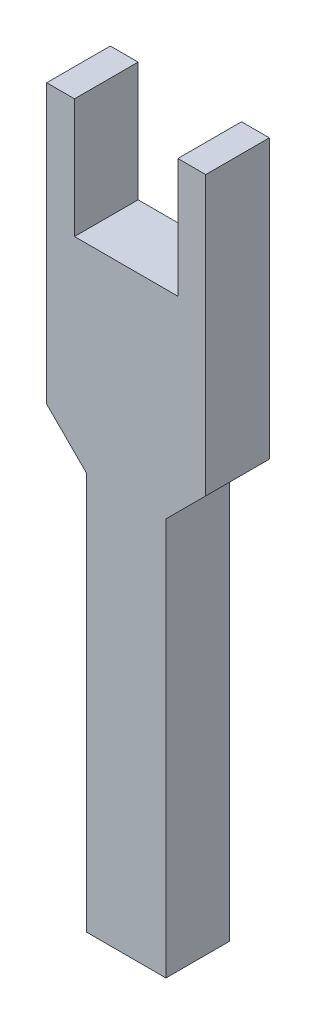
ISO-10303-21;
HEADER;
FILE_DESCRIPTION(('STEP AP214'),'2;1');
FILE_NAME('part.step','',(''),(''),'','','');
FILE_SCHEMA(('AUTOMOTIVE_DESIGN { 1 0 10303 214 1 1 1 1 }'));
ENDSEC;
DATA;
#1=APPLICATION_CONTEXT('core data for automotive mechanical design processes');
#2=APPLICATION_PROTOCOL_DEFINITION('international standard','automotive_design',2000,#1);
#3=PRODUCT_CONTEXT('',#1,'mechanical');
#4=PRODUCT('Part','Part','',(#3));
#5=PRODUCT_RELATED_PRODUCT_CATEGORY('part','',(#4));
#6=PRODUCT_DEFINITION_FORMATION('','',#4);
#7=PRODUCT_DEFINITION_CONTEXT('part definition',#1,'design');
#8=PRODUCT_DEFINITION('design','',#6,#7);
#9=PRODUCT_DEFINITION_SHAPE('','',#8);
#10=(LENGTH_UNIT() NAMED_UNIT(*) SI_UNIT(.MILLI.,.METRE.));
#11=(NAMED_UNIT(*) PLANE_ANGLE_UNIT() SI_UNIT($,.RADIAN.));
#12=(NAMED_UNIT(*) SI_UNIT($,.STERADIAN.) SOLID_ANGLE_UNIT());
#13=UNCERTAINTY_MEASURE_WITH_UNIT(LENGTH_MEASURE(1.E-05),#10,'distance_accuracy_value','');
#14=(GEOMETRIC_REPRESENTATION_CONTEXT(3) GLOBAL_UNCERTAINTY_ASSIGNED_CONTEXT((#13)) GLOBAL_UNIT_ASSIGNED_CONTEXT((#10,
#11,#12)) REPRESENTATION_CONTEXT('',''));
#15=CARTESIAN_POINT('',(0.,0.,0.));
#16=DIRECTION('',(0.,0.,1.));
#17=DIRECTION('',(1.,0.,0.));
#18=AXIS2_PLACEMENT_3D('',#15,#16,#17);
#19=CARTESIAN_POINT('',(-10.,20.,8.));
#20=DIRECTION('',(0.,-1.,0.));
#21=DIRECTION('',(0.,0.,-1.));
#22=AXIS2_PLACEMENT_3D('',#19,#20,#21);
#23=PLANE('',#22);
#24=DIRECTION('',(-1.,0.,0.));
#25=VECTOR('',#24,1.);
#26=CARTESIAN_POINT('',(-10.,20.,8.));
#27=LINE('',#26,#25);
#28=CARTESIAN_POINT('',(-6.5,20.,8.));
#29=VERTEX_POINT('',#28);
#30=CARTESIAN_POINT('',(-10.,20.,8.));
#31=VERTEX_POINT('',#30);
#32=EDGE_CURVE('E175',#29,#31,#27,.T.);
#33=ORIENTED_EDGE('',*,*,#32,.F.);
#34=DIRECTION('',(0.,0.,-1.));
#35=VECTOR('',#34,1.);
#36=CARTESIAN_POINT('',(-6.5,20.,8.));
#37=LINE('',#36,#35);
#38=CARTESIAN_POINT('',(-6.5,20.,0.));
#39=VERTEX_POINT('',#38);
#40=EDGE_CURVE('E158',#29,#39,#37,.T.);
#41=ORIENTED_EDGE('',*,*,#40,.T.);
#42=DIRECTION('',(-1.,0.,0.));
#43=VECTOR('',#42,1.);
#44=CARTESIAN_POINT('',(-10.,20.,0.));
#45=LINE('',#44,#43);
#46=CARTESIAN_POINT('',(-10.,20.,0.));
#47=VERTEX_POINT('',#46);
#48=EDGE_CURVE('E185',#39,#47,#45,.T.);
#49=ORIENTED_EDGE('',*,*,#48,.T.);
#50=DIRECTION('',(0.,0.,-1.));
#51=VECTOR('',#50,1.);
#52=CARTESIAN_POINT('',(-10.,20.,8.));
#53=LINE('',#52,#51);
#54=EDGE_CURVE('E183',#31,#47,#53,.T.);
#55=ORIENTED_EDGE('',*,*,#54,.F.);
#56=EDGE_LOOP('',(#33,#41,#49,#55));
#57=FACE_BOUND('',#56,.T.);
#58=ADVANCED_FACE('F33',(#57),#23,.F.);
#59=CARTESIAN_POINT('',(10.,20.,8.));
#60=DIRECTION('',(-1.,0.,0.));
#61=DIRECTION('',(0.,-1.,0.));
#62=AXIS2_PLACEMENT_3D('',#59,#60,#61);
#63=PLANE('',#62);
#64=DIRECTION('',(0.,1.,0.));
#65=VECTOR('',#64,1.);
#66=CARTESIAN_POINT('',(10.,20.,8.));
#67=LINE('',#66,#65);
#68=CARTESIAN_POINT('',(10.,-15.,8.));
#69=VERTEX_POINT('',#68);
#70=CARTESIAN_POINT('',(10.,20.,8.));
#71=VERTEX_POINT('',#70);
#72=EDGE_CURVE('E173',#69,#71,#67,.T.);
#73=ORIENTED_EDGE('',*,*,#72,.F.);
#74=DIRECTION('',(0.,0.,-1.));
#75=VECTOR('',#74,1.);
#76=CARTESIAN_POINT('',(10.,-15.,8.));
#77=LINE('',#76,#75);
#78=CARTESIAN_POINT('',(10.,-15.,0.));
#79=VERTEX_POINT('',#78);
#80=EDGE_CURVE('E205',#69,#79,#77,.T.);
#81=ORIENTED_EDGE('',*,*,#80,.T.);
#82=DIRECTION('',(0.,1.,0.));
#83=VECTOR('',#82,1.);
#84=CARTESIAN_POINT('',(10.,20.,0.));
#85=LINE('',#84,#83);
#86=CARTESIAN_POINT('',(10.,20.,0.));
#87=VERTEX_POINT('',#86);
#88=EDGE_CURVE('E166',#79,#87,#85,.T.);
#89=ORIENTED_EDGE('',*,*,#88,.T.);
#90=DIRECTION('',(0.,0.,-1.));
#91=VECTOR('',#90,1.);
#92=CARTESIAN_POINT('',(10.,20.,8.));
#93=LINE('',#92,#91);
#94=EDGE_CURVE('E193',#71,#87,#93,.T.);
#95=ORIENTED_EDGE('',*,*,#94,.F.);
#96=EDGE_LOOP('',(#73,#81,#89,#95));
#97=FACE_BOUND('',#96,.T.);
#98=ADVANCED_FACE('F210',(#97),#63,.F.);
#99=CARTESIAN_POINT('',(6.5,20.,0.));
#100=VERTEX_POINT('',#99);
#101=EDGE_CURVE('E186',#87,#100,#45,.T.);
#102=ORIENTED_EDGE('',*,*,#101,.T.);
#103=DIRECTION('',(0.,0.,-1.));
#104=VECTOR('',#103,1.);
#105=CARTESIAN_POINT('',(6.5,20.,8.));
#106=LINE('',#105,#104);
#107=CARTESIAN_POINT('',(6.5,20.,8.));
#108=VERTEX_POINT('',#107);
#109=EDGE_CURVE('E169',#108,#100,#106,.T.);
#110=ORIENTED_EDGE('',*,*,#109,.F.);
#111=EDGE_CURVE('E177',#71,#108,#27,.T.);
#112=ORIENTED_EDGE('',*,*,#111,.F.);
#113=ORIENTED_EDGE('',*,*,#94,.T.);
#114=EDGE_LOOP('',(#102,#110,#112,#113));
#115=FACE_BOUND('',#114,.T.);
#116=ADVANCED_FACE('F219',(#115),#23,.F.);
#117=CARTESIAN_POINT('',(-10.,20.,8.));
#118=DIRECTION('',(1.,0.,0.));
#119=DIRECTION('',(0.,1.,0.));
#120=AXIS2_PLACEMENT_3D('',#117,#118,#119);
#121=PLANE('',#120);
#122=DIRECTION('',(0.,-1.,0.));
#123=VECTOR('',#122,1.);
#124=CARTESIAN_POINT('',(-10.,20.,0.));
#125=LINE('',#124,#123);
#126=CARTESIAN_POINT('',(-10.,-15.,0.));
#127=VERTEX_POINT('',#126);
#128=EDGE_CURVE('E176',#47,#127,#125,.T.);
#129=ORIENTED_EDGE('',*,*,#128,.T.);
#130=DIRECTION('',(0.,0.,1.));
#131=VECTOR('',#130,1.);
#132=CARTESIAN_POINT('',(-10.,-15.,8.));
#133=LINE('',#132,#131);
#134=CARTESIAN_POINT('',(-10.,-15.,8.));
#135=VERTEX_POINT('',#134);
#136=EDGE_CURVE('E201',#127,#135,#133,.T.);
#137=ORIENTED_EDGE('',*,*,#136,.T.);
#138=DIRECTION('',(0.,-1.,0.));
#139=VECTOR('',#138,1.);
#140=CARTESIAN_POINT('',(-10.,20.,8.));
#141=LINE('',#140,#139);
#142=EDGE_CURVE('E180',#31,#135,#141,.T.);
#143=ORIENTED_EDGE('',*,*,#142,.F.);
#144=ORIENTED_EDGE('',*,*,#54,.T.);
#145=EDGE_LOOP('',(#129,#137,#143,#144));
#146=FACE_BOUND('',#145,.T.);
#147=ADVANCED_FACE('F236',(#146),#121,.F.);
#148=CARTESIAN_POINT('',(0.,0.,8.));
#149=DIRECTION('',(0.,0.,1.));
#150=DIRECTION('',(1.,0.,0.));
#151=AXIS2_PLACEMENT_3D('',#148,#149,#150);
#152=PLANE('',#151);
#153=DIRECTION('',(-0.707106781186546,0.707106781186549,0.));
#154=VECTOR('',#153,1.);
#155=CARTESIAN_POINT('',(-12.5,-12.5,8.));
#156=LINE('',#155,#154);
#157=CARTESIAN_POINT('',(-5.00000000000001,-20.,8.));
#158=VERTEX_POINT('',#157);
#159=EDGE_CURVE('E203',#135,#158,#156,.F.);
#160=ORIENTED_EDGE('',*,*,#159,.T.);
#161=DIRECTION('',(0.,1.,0.));
#162=VECTOR('',#161,1.);
#163=CARTESIAN_POINT('',(-5.00000000000001,-70.,8.));
#164=LINE('',#163,#162);
#165=CARTESIAN_POINT('',(-5.00000000000001,-70.,8.));
#166=VERTEX_POINT('',#165);
#167=EDGE_CURVE('E127',#166,#158,#164,.T.);
#168=ORIENTED_EDGE('',*,*,#167,.F.);
#169=DIRECTION('',(-1.,0.,0.));
#170=VECTOR('',#169,1.);
#171=CARTESIAN_POINT('',(4.99999999999998,-70.,8.));
#172=LINE('',#171,#170);
#173=CARTESIAN_POINT('',(4.99999999999998,-70.,8.));
#174=VERTEX_POINT('',#173);
#175=EDGE_CURVE('E120',#174,#166,#172,.T.);
#176=ORIENTED_EDGE('',*,*,#175,.F.);
#177=DIRECTION('',(0.,1.,0.));
#178=VECTOR('',#177,1.);
#179=CARTESIAN_POINT('',(4.99999999999998,-70.,8.));
#180=LINE('',#179,#178);
#181=CARTESIAN_POINT('',(4.99999999999998,-20.,8.));
#182=VERTEX_POINT('',#181);
#183=EDGE_CURVE('E124',#174,#182,#180,.T.);
#184=ORIENTED_EDGE('',*,*,#183,.T.);
#185=DIRECTION('',(-0.707106781186549,-0.707106781186546,0.));
#186=VECTOR('',#185,1.);
#187=CARTESIAN_POINT('',(12.5,-12.5,8.));
#188=LINE('',#187,#186);
#189=EDGE_CURVE('E11',#182,#69,#188,.F.);
#190=ORIENTED_EDGE('',*,*,#189,.T.);
#191=ORIENTED_EDGE('',*,*,#72,.T.);
#192=ORIENTED_EDGE('',*,*,#111,.T.);
#193=DIRECTION('',(0.,-1.,0.));
#194=VECTOR('',#193,1.);
#195=CARTESIAN_POINT('',(6.5,20.,8.));
#196=LINE('',#195,#194);
#197=CARTESIAN_POINT('',(6.5,5.,8.));
#198=VERTEX_POINT('',#197);
#199=EDGE_CURVE('E152',#108,#198,#196,.T.);
#200=ORIENTED_EDGE('',*,*,#199,.T.);
#201=DIRECTION('',(-1.,0.,0.));
#202=VECTOR('',#201,1.);
#203=CARTESIAN_POINT('',(6.5,5.,8.));
#204=LINE('',#203,#202);
#205=CARTESIAN_POINT('',(-6.5,5.,8.));
#206=VERTEX_POINT('',#205);
#207=EDGE_CURVE('E156',#198,#206,#204,.T.);
#208=ORIENTED_EDGE('',*,*,#207,.T.);
#209=DIRECTION('',(0.,1.,0.));
#210=VECTOR('',#209,1.);
#211=CARTESIAN_POINT('',(-6.5,20.,8.));
#212=LINE('',#211,#210);
#213=EDGE_CURVE('E149',#206,#29,#212,.T.);
#214=ORIENTED_EDGE('',*,*,#213,.T.);
#215=ORIENTED_EDGE('',*,*,#32,.T.);
#216=ORIENTED_EDGE('',*,*,#142,.T.);
#217=EDGE_LOOP('',(#160,#168,#176,#184,#190,#191,#192,#200,#208,#214,#215,#216));
#218=FACE_BOUND('',#217,.T.);
#219=ADVANCED_FACE('F122',(#218),#152,.T.);
#220=CARTESIAN_POINT('',(0.,0.,0.));
#221=DIRECTION('',(0.,0.,1.));
#222=DIRECTION('',(1.,0.,0.));
#223=AXIS2_PLACEMENT_3D('',#220,#221,#222);
#224=PLANE('',#223);
#225=ORIENTED_EDGE('',*,*,#88,.F.);
#226=DIRECTION('',(0.707106781186549,0.707106781186546,0.));
#227=VECTOR('',#226,1.);
#228=CARTESIAN_POINT('',(10.,-15.,0.));
#229=LINE('',#228,#227);
#230=CARTESIAN_POINT('',(4.99999999999998,-20.,0.));
#231=VERTEX_POINT('',#230);
#232=EDGE_CURVE('E54',#79,#231,#229,.F.);
#233=ORIENTED_EDGE('',*,*,#232,.T.);
#234=DIRECTION('',(0.,1.,0.));
#235=VECTOR('',#234,1.);
#236=CARTESIAN_POINT('',(4.99999999999998,-70.,0.));
#237=LINE('',#236,#235);
#238=CARTESIAN_POINT('',(4.99999999999998,-70.,0.));
#239=VERTEX_POINT('',#238);
#240=EDGE_CURVE('E247',#239,#231,#237,.T.);
#241=ORIENTED_EDGE('',*,*,#240,.F.);
#242=DIRECTION('',(1.,0.,0.));
#243=VECTOR('',#242,1.);
#244=CARTESIAN_POINT('',(4.99999999999998,-70.,0.));
#245=LINE('',#244,#243);
#246=CARTESIAN_POINT('',(-5.00000000000001,-70.,0.));
#247=VERTEX_POINT('',#246);
#248=EDGE_CURVE('E136',#247,#239,#245,.T.);
#249=ORIENTED_EDGE('',*,*,#248,.F.);
#250=DIRECTION('',(0.,1.,0.));
#251=VECTOR('',#250,1.);
#252=CARTESIAN_POINT('',(-5.00000000000001,-70.,0.));
#253=LINE('',#252,#251);
#254=CARTESIAN_POINT('',(-5.00000000000001,-20.,0.));
#255=VERTEX_POINT('',#254);
#256=EDGE_CURVE('E145',#247,#255,#253,.T.);
#257=ORIENTED_EDGE('',*,*,#256,.T.);
#258=DIRECTION('',(0.707106781186546,-0.707106781186549,0.));
#259=VECTOR('',#258,1.);
#260=CARTESIAN_POINT('',(-5.00000000000001,-20.,0.));
#261=LINE('',#260,#259);
#262=EDGE_CURVE('E199',#255,#127,#261,.F.);
#263=ORIENTED_EDGE('',*,*,#262,.T.);
#264=ORIENTED_EDGE('',*,*,#128,.F.);
#265=ORIENTED_EDGE('',*,*,#48,.F.);
#266=DIRECTION('',(0.,1.,0.));
#267=VECTOR('',#266,1.);
#268=CARTESIAN_POINT('',(-6.5,20.,0.));
#269=LINE('',#268,#267);
#270=CARTESIAN_POINT('',(-6.5,5.,0.));
#271=VERTEX_POINT('',#270);
#272=EDGE_CURVE('E141',#271,#39,#269,.T.);
#273=ORIENTED_EDGE('',*,*,#272,.F.);
#274=DIRECTION('',(-1.,0.,0.));
#275=VECTOR('',#274,1.);
#276=CARTESIAN_POINT('',(6.5,5.,0.));
#277=LINE('',#276,#275);
#278=CARTESIAN_POINT('',(6.5,5.,0.));
#279=VERTEX_POINT('',#278);
#280=EDGE_CURVE('E153',#279,#271,#277,.T.);
#281=ORIENTED_EDGE('',*,*,#280,.F.);
#282=DIRECTION('',(0.,-1.,0.));
#283=VECTOR('',#282,1.);
#284=CARTESIAN_POINT('',(6.5,20.,0.));
#285=LINE('',#284,#283);
#286=EDGE_CURVE('E143',#100,#279,#285,.T.);
#287=ORIENTED_EDGE('',*,*,#286,.F.);
#288=ORIENTED_EDGE('',*,*,#101,.F.);
#289=EDGE_LOOP('',(#225,#233,#241,#249,#257,#263,#264,#265,#273,#281,#287,#288));
#290=FACE_BOUND('',#289,.T.);
#291=ADVANCED_FACE('F213',(#290),#224,.F.);
#292=CARTESIAN_POINT('',(-6.5,20.,8.));
#293=DIRECTION('',(-1.,0.,0.));
#294=DIRECTION('',(0.,-1.,0.));
#295=AXIS2_PLACEMENT_3D('',#292,#293,#294);
#296=PLANE('',#295);
#297=ORIENTED_EDGE('',*,*,#272,.T.);
#298=ORIENTED_EDGE('',*,*,#40,.F.);
#299=ORIENTED_EDGE('',*,*,#213,.F.);
#300=DIRECTION('',(0.,0.,-1.));
#301=VECTOR('',#300,1.);
#302=CARTESIAN_POINT('',(-6.5,5.,8.));
#303=LINE('',#302,#301);
#304=EDGE_CURVE('E164',#206,#271,#303,.T.);
#305=ORIENTED_EDGE('',*,*,#304,.T.);
#306=EDGE_LOOP('',(#297,#298,#299,#305));
#307=FACE_BOUND('',#306,.T.);
#308=ADVANCED_FACE('F228',(#307),#296,.F.);
#309=CARTESIAN_POINT('',(6.5,5.,8.));
#310=DIRECTION('',(0.,-1.,0.));
#311=DIRECTION('',(0.,0.,-1.));
#312=AXIS2_PLACEMENT_3D('',#309,#310,#311);
#313=PLANE('',#312);
#314=ORIENTED_EDGE('',*,*,#280,.T.);
#315=ORIENTED_EDGE('',*,*,#304,.F.);
#316=ORIENTED_EDGE('',*,*,#207,.F.);
#317=DIRECTION('',(0.,0.,-1.));
#318=VECTOR('',#317,1.);
#319=CARTESIAN_POINT('',(6.5,5.,8.));
#320=LINE('',#319,#318);
#321=EDGE_CURVE('E167',#198,#279,#320,.T.);
#322=ORIENTED_EDGE('',*,*,#321,.T.);
#323=EDGE_LOOP('',(#314,#315,#316,#322));
#324=FACE_BOUND('',#323,.T.);
#325=ADVANCED_FACE('F224',(#324),#313,.F.);
#326=CARTESIAN_POINT('',(6.5,20.,8.));
#327=DIRECTION('',(1.,0.,0.));
#328=DIRECTION('',(0.,1.,0.));
#329=AXIS2_PLACEMENT_3D('',#326,#327,#328);
#330=PLANE('',#329);
#331=ORIENTED_EDGE('',*,*,#286,.T.);
#332=ORIENTED_EDGE('',*,*,#321,.F.);
#333=ORIENTED_EDGE('',*,*,#199,.F.);
#334=ORIENTED_EDGE('',*,*,#109,.T.);
#335=EDGE_LOOP('',(#331,#332,#333,#334));
#336=FACE_BOUND('',#335,.T.);
#337=ADVANCED_FACE('F222',(#336),#330,.F.);
#338=CARTESIAN_POINT('',(-5.00000000000001,-20.,8.));
#339=DIRECTION('',(0.707106781186549,0.707106781186546,0.));
#340=DIRECTION('',(0.,0.,-1.));
#341=AXIS2_PLACEMENT_3D('',#338,#339,#340);
#342=PLANE('',#341);
#343=ORIENTED_EDGE('',*,*,#159,.F.);
#344=ORIENTED_EDGE('',*,*,#136,.F.);
#345=ORIENTED_EDGE('',*,*,#262,.F.);
#346=DIRECTION('',(0.,0.,-1.));
#347=VECTOR('',#346,1.);
#348=CARTESIAN_POINT('',(-5.00000000000001,-20.,8.));
#349=LINE('',#348,#347);
#350=EDGE_CURVE('E196',#158,#255,#349,.T.);
#351=ORIENTED_EDGE('',*,*,#350,.F.);
#352=EDGE_LOOP('',(#343,#344,#345,#351));
#353=FACE_BOUND('',#352,.T.);
#354=ADVANCED_FACE('F241',(#353),#342,.F.);
#355=CARTESIAN_POINT('',(10.,-15.,8.));
#356=DIRECTION('',(-0.707106781186546,0.707106781186549,0.));
#357=DIRECTION('',(0.,0.,-1.));
#358=AXIS2_PLACEMENT_3D('',#355,#356,#357);
#359=PLANE('',#358);
#360=ORIENTED_EDGE('',*,*,#189,.F.);
#361=DIRECTION('',(0.,0.,1.));
#362=VECTOR('',#361,1.);
#363=CARTESIAN_POINT('',(4.99999999999998,-20.,8.));
#364=LINE('',#363,#362);
#365=EDGE_CURVE('E41',#231,#182,#364,.T.);
#366=ORIENTED_EDGE('',*,*,#365,.F.);
#367=ORIENTED_EDGE('',*,*,#232,.F.);
#368=ORIENTED_EDGE('',*,*,#80,.F.);
#369=EDGE_LOOP('',(#360,#366,#367,#368));
#370=FACE_BOUND('',#369,.T.);
#371=ADVANCED_FACE('F35',(#370),#359,.F.);
#372=CARTESIAN_POINT('',(4.99999999999998,-70.,8.));
#373=DIRECTION('',(-1.,0.,0.));
#374=DIRECTION('',(0.,0.,1.));
#375=AXIS2_PLACEMENT_3D('',#372,#373,#374);
#376=PLANE('',#375);
#377=ORIENTED_EDGE('',*,*,#365,.T.);
#378=ORIENTED_EDGE('',*,*,#183,.F.);
#379=DIRECTION('',(0.,0.,1.));
#380=VECTOR('',#379,1.);
#381=CARTESIAN_POINT('',(4.99999999999998,-70.,8.));
#382=LINE('',#381,#380);
#383=EDGE_CURVE('E131',#239,#174,#382,.T.);
#384=ORIENTED_EDGE('',*,*,#383,.F.);
#385=ORIENTED_EDGE('',*,*,#240,.T.);
#386=EDGE_LOOP('',(#377,#378,#384,#385));
#387=FACE_BOUND('',#386,.T.);
#388=ADVANCED_FACE('F140',(#387),#376,.F.);
#389=CARTESIAN_POINT('',(-5.00000000000001,-70.,8.));
#390=DIRECTION('',(1.,0.,0.));
#391=DIRECTION('',(0.,0.,-1.));
#392=AXIS2_PLACEMENT_3D('',#389,#390,#391);
#393=PLANE('',#392);
#394=ORIENTED_EDGE('',*,*,#350,.T.);
#395=ORIENTED_EDGE('',*,*,#256,.F.);
#396=DIRECTION('',(0.,0.,-1.));
#397=VECTOR('',#396,1.);
#398=CARTESIAN_POINT('',(-5.00000000000001,-70.,8.));
#399=LINE('',#398,#397);
#400=EDGE_CURVE('E130',#166,#247,#399,.T.);
#401=ORIENTED_EDGE('',*,*,#400,.F.);
#402=ORIENTED_EDGE('',*,*,#167,.T.);
#403=EDGE_LOOP('',(#394,#395,#401,#402));
#404=FACE_BOUND('',#403,.T.);
#405=ADVANCED_FACE('F245',(#404),#393,.F.);
#406=CARTESIAN_POINT('',(0.,-70.,0.));
#407=DIRECTION('',(0.,1.,0.));
#408=DIRECTION('',(0.,0.,1.));
#409=AXIS2_PLACEMENT_3D('',#406,#407,#408);
#410=PLANE('',#409);
#411=ORIENTED_EDGE('',*,*,#383,.T.);
#412=ORIENTED_EDGE('',*,*,#175,.T.);
#413=ORIENTED_EDGE('',*,*,#400,.T.);
#414=ORIENTED_EDGE('',*,*,#248,.T.);
#415=EDGE_LOOP('',(#411,#412,#413,#414));
#416=FACE_BOUND('',#415,.T.);
#417=ADVANCED_FACE('F134',(#416),#410,.F.);
#418=CLOSED_SHELL('',(#58,#98,#116,#147,#219,#291,#308,#325,#337,#354,#371,#388,#405,#417));
#419=MANIFOLD_SOLID_BREP('B2',#418);
#420=ADVANCED_BREP_SHAPE_REPRESENTATION('',(#18,#419),#14);
#421=SHAPE_DEFINITION_REPRESENTATION(#9,#420);
ENDSEC;
END-ISO-10303-21;
